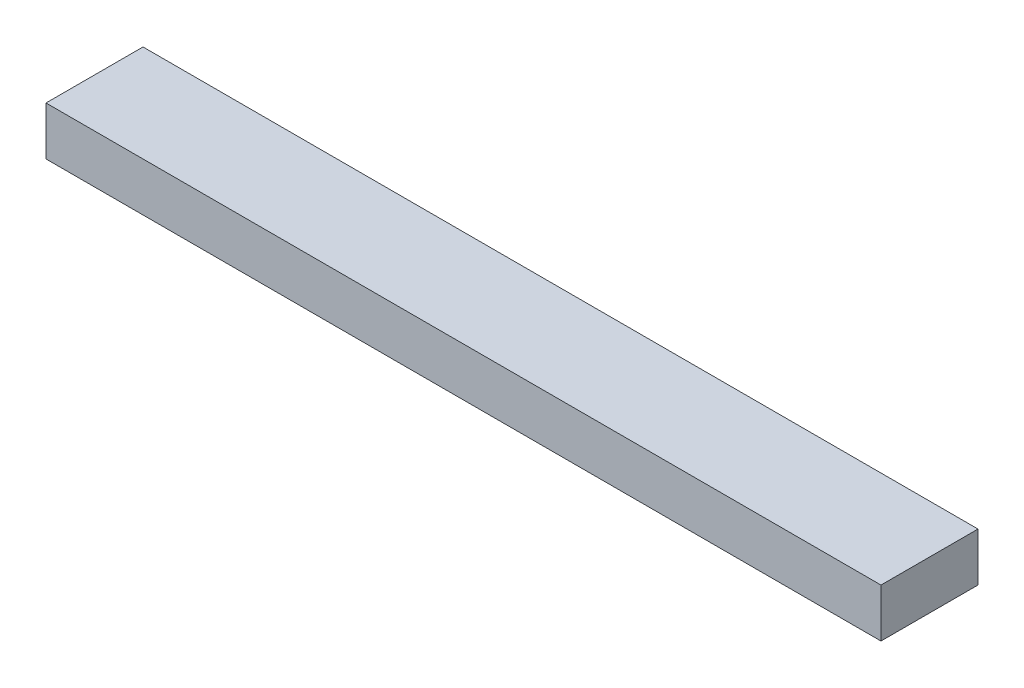
ISO-10303-21;
HEADER;
FILE_DESCRIPTION(('STEP AP214'),'2;1');
FILE_NAME('part.step','',(''),(''),'','','');
FILE_SCHEMA(('AUTOMOTIVE_DESIGN { 1 0 10303 214 1 1 1 1 }'));
ENDSEC;
DATA;
#1=APPLICATION_CONTEXT('core data for automotive mechanical design processes');
#2=APPLICATION_PROTOCOL_DEFINITION('international standard','automotive_design',2000,#1);
#3=PRODUCT_CONTEXT('',#1,'mechanical');
#4=PRODUCT('Part','Part','',(#3));
#5=PRODUCT_RELATED_PRODUCT_CATEGORY('part','',(#4));
#6=PRODUCT_DEFINITION_FORMATION('','',#4);
#7=PRODUCT_DEFINITION_CONTEXT('part definition',#1,'design');
#8=PRODUCT_DEFINITION('design','',#6,#7);
#9=PRODUCT_DEFINITION_SHAPE('','',#8);
#10=(LENGTH_UNIT() NAMED_UNIT(*) SI_UNIT(.MILLI.,.METRE.));
#11=(NAMED_UNIT(*) PLANE_ANGLE_UNIT() SI_UNIT($,.RADIAN.));
#12=(NAMED_UNIT(*) SI_UNIT($,.STERADIAN.) SOLID_ANGLE_UNIT());
#13=UNCERTAINTY_MEASURE_WITH_UNIT(LENGTH_MEASURE(1.E-05),#10,'distance_accuracy_value','');
#14=(GEOMETRIC_REPRESENTATION_CONTEXT(3) GLOBAL_UNCERTAINTY_ASSIGNED_CONTEXT((#13)) GLOBAL_UNIT_ASSIGNED_CONTEXT((#10,
#11,#12)) REPRESENTATION_CONTEXT('',''));
#15=CARTESIAN_POINT('',(0.,0.,0.));
#16=DIRECTION('',(0.,0.,1.));
#17=DIRECTION('',(1.,0.,0.));
#18=AXIS2_PLACEMENT_3D('',#15,#16,#17);
#19=CARTESIAN_POINT('',(437.1975,25.4,50.8));
#20=DIRECTION('',(-1.,0.,0.));
#21=DIRECTION('',(0.,0.,1.));
#22=AXIS2_PLACEMENT_3D('',#19,#20,#21);
#23=PLANE('',#22);
#24=DIRECTION('',(0.,0.,-1.));
#25=VECTOR('',#24,1.);
#26=CARTESIAN_POINT('',(437.1975,-25.4,50.8));
#27=LINE('',#26,#25);
#28=CARTESIAN_POINT('',(437.1975,-25.4,50.8));
#29=VERTEX_POINT('',#28);
#30=CARTESIAN_POINT('',(437.1975,-25.4,-50.8));
#31=VERTEX_POINT('',#30);
#32=EDGE_CURVE('E111',#29,#31,#27,.T.);
#33=ORIENTED_EDGE('',*,*,#32,.T.);
#34=DIRECTION('',(0.,-1.,0.));
#35=VECTOR('',#34,1.);
#36=CARTESIAN_POINT('',(437.1975,25.4,-50.8));
#37=LINE('',#36,#35);
#38=CARTESIAN_POINT('',(437.1975,25.4,-50.8));
#39=VERTEX_POINT('',#38);
#40=EDGE_CURVE('E11',#39,#31,#37,.T.);
#41=ORIENTED_EDGE('',*,*,#40,.F.);
#42=DIRECTION('',(0.,0.,-1.));
#43=VECTOR('',#42,1.);
#44=CARTESIAN_POINT('',(437.1975,25.4,50.8));
#45=LINE('',#44,#43);
#46=CARTESIAN_POINT('',(437.1975,25.4,50.8));
#47=VERTEX_POINT('',#46);
#48=EDGE_CURVE('E95',#47,#39,#45,.T.);
#49=ORIENTED_EDGE('',*,*,#48,.F.);
#50=DIRECTION('',(0.,-1.,0.));
#51=VECTOR('',#50,1.);
#52=CARTESIAN_POINT('',(437.1975,25.4,50.8));
#53=LINE('',#52,#51);
#54=EDGE_CURVE('E107',#47,#29,#53,.T.);
#55=ORIENTED_EDGE('',*,*,#54,.T.);
#56=EDGE_LOOP('',(#33,#41,#49,#55));
#57=FACE_BOUND('',#56,.T.);
#58=ADVANCED_FACE('F43',(#57),#23,.F.);
#59=CARTESIAN_POINT('',(-437.1975,25.4,-50.8));
#60=DIRECTION('',(0.,0.,1.));
#61=DIRECTION('',(1.,0.,0.));
#62=AXIS2_PLACEMENT_3D('',#59,#60,#61);
#63=PLANE('',#62);
#64=DIRECTION('',(-1.,0.,0.));
#65=VECTOR('',#64,1.);
#66=CARTESIAN_POINT('',(-437.1975,-25.4,-50.8));
#67=LINE('',#66,#65);
#68=CARTESIAN_POINT('',(-437.1975,-25.4,-50.8));
#69=VERTEX_POINT('',#68);
#70=EDGE_CURVE('E100',#31,#69,#67,.T.);
#71=ORIENTED_EDGE('',*,*,#70,.T.);
#72=DIRECTION('',(0.,-1.,0.));
#73=VECTOR('',#72,1.);
#74=CARTESIAN_POINT('',(-437.1975,25.4,-50.8));
#75=LINE('',#74,#73);
#76=CARTESIAN_POINT('',(-437.1975,25.4,-50.8));
#77=VERTEX_POINT('',#76);
#78=EDGE_CURVE('E52',#77,#69,#75,.T.);
#79=ORIENTED_EDGE('',*,*,#78,.F.);
#80=DIRECTION('',(-1.,0.,0.));
#81=VECTOR('',#80,1.);
#82=CARTESIAN_POINT('',(-437.1975,25.4,-50.8));
#83=LINE('',#82,#81);
#84=EDGE_CURVE('E90',#39,#77,#83,.T.);
#85=ORIENTED_EDGE('',*,*,#84,.F.);
#86=ORIENTED_EDGE('',*,*,#40,.T.);
#87=EDGE_LOOP('',(#71,#79,#85,#86));
#88=FACE_BOUND('',#87,.T.);
#89=ADVANCED_FACE('F99',(#88),#63,.F.);
#90=CARTESIAN_POINT('',(-437.1975,25.4,50.8));
#91=DIRECTION('',(1.,0.,0.));
#92=DIRECTION('',(0.,0.,-1.));
#93=AXIS2_PLACEMENT_3D('',#90,#91,#92);
#94=PLANE('',#93);
#95=DIRECTION('',(0.,0.,1.));
#96=VECTOR('',#95,1.);
#97=CARTESIAN_POINT('',(-437.1975,-25.4,50.8));
#98=LINE('',#97,#96);
#99=CARTESIAN_POINT('',(-437.1975,-25.4,50.8));
#100=VERTEX_POINT('',#99);
#101=EDGE_CURVE('E77',#69,#100,#98,.T.);
#102=ORIENTED_EDGE('',*,*,#101,.T.);
#103=DIRECTION('',(0.,-1.,0.));
#104=VECTOR('',#103,1.);
#105=CARTESIAN_POINT('',(-437.1975,25.4,50.8));
#106=LINE('',#105,#104);
#107=CARTESIAN_POINT('',(-437.1975,25.4,50.8));
#108=VERTEX_POINT('',#107);
#109=EDGE_CURVE('E102',#108,#100,#106,.T.);
#110=ORIENTED_EDGE('',*,*,#109,.F.);
#111=DIRECTION('',(0.,0.,1.));
#112=VECTOR('',#111,1.);
#113=CARTESIAN_POINT('',(-437.1975,25.4,50.8));
#114=LINE('',#113,#112);
#115=EDGE_CURVE('E93',#77,#108,#114,.T.);
#116=ORIENTED_EDGE('',*,*,#115,.F.);
#117=ORIENTED_EDGE('',*,*,#78,.T.);
#118=EDGE_LOOP('',(#102,#110,#116,#117));
#119=FACE_BOUND('',#118,.T.);
#120=ADVANCED_FACE('F103',(#119),#94,.F.);
#121=CARTESIAN_POINT('',(-437.1975,25.4,50.8));
#122=DIRECTION('',(0.,0.,-1.));
#123=DIRECTION('',(-1.,0.,0.));
#124=AXIS2_PLACEMENT_3D('',#121,#122,#123);
#125=PLANE('',#124);
#126=DIRECTION('',(1.,0.,0.));
#127=VECTOR('',#126,1.);
#128=CARTESIAN_POINT('',(-437.1975,-25.4,50.8));
#129=LINE('',#128,#127);
#130=EDGE_CURVE('E83',#100,#29,#129,.T.);
#131=ORIENTED_EDGE('',*,*,#130,.T.);
#132=ORIENTED_EDGE('',*,*,#54,.F.);
#133=DIRECTION('',(1.,0.,0.));
#134=VECTOR('',#133,1.);
#135=CARTESIAN_POINT('',(-437.1975,25.4,50.8));
#136=LINE('',#135,#134);
#137=EDGE_CURVE('E60',#108,#47,#136,.T.);
#138=ORIENTED_EDGE('',*,*,#137,.F.);
#139=ORIENTED_EDGE('',*,*,#109,.T.);
#140=EDGE_LOOP('',(#131,#132,#138,#139));
#141=FACE_BOUND('',#140,.T.);
#142=ADVANCED_FACE('F124',(#141),#125,.F.);
#143=CARTESIAN_POINT('',(0.,25.4,0.));
#144=DIRECTION('',(0.,-1.,0.));
#145=DIRECTION('',(0.,0.,-1.));
#146=AXIS2_PLACEMENT_3D('',#143,#144,#145);
#147=PLANE('',#146);
#148=ORIENTED_EDGE('',*,*,#48,.T.);
#149=ORIENTED_EDGE('',*,*,#84,.T.);
#150=ORIENTED_EDGE('',*,*,#115,.T.);
#151=ORIENTED_EDGE('',*,*,#137,.T.);
#152=EDGE_LOOP('',(#148,#149,#150,#151));
#153=FACE_BOUND('',#152,.T.);
#154=ADVANCED_FACE('F91',(#153),#147,.F.);
#155=CARTESIAN_POINT('',(0.,-25.4,0.));
#156=DIRECTION('',(0.,-1.,0.));
#157=DIRECTION('',(0.,0.,-1.));
#158=AXIS2_PLACEMENT_3D('',#155,#156,#157);
#159=PLANE('',#158);
#160=ORIENTED_EDGE('',*,*,#32,.F.);
#161=ORIENTED_EDGE('',*,*,#130,.F.);
#162=ORIENTED_EDGE('',*,*,#101,.F.);
#163=ORIENTED_EDGE('',*,*,#70,.F.);
#164=EDGE_LOOP('',(#160,#161,#162,#163));
#165=FACE_BOUND('',#164,.T.);
#166=ADVANCED_FACE('F127',(#165),#159,.T.);
#167=CLOSED_SHELL('',(#58,#89,#120,#142,#154,#166));
#168=MANIFOLD_SOLID_BREP('B2',#167);
#169=ADVANCED_BREP_SHAPE_REPRESENTATION('',(#18,#168),#14);
#170=SHAPE_DEFINITION_REPRESENTATION(#9,#169);
ENDSEC;
END-ISO-10303-21;
